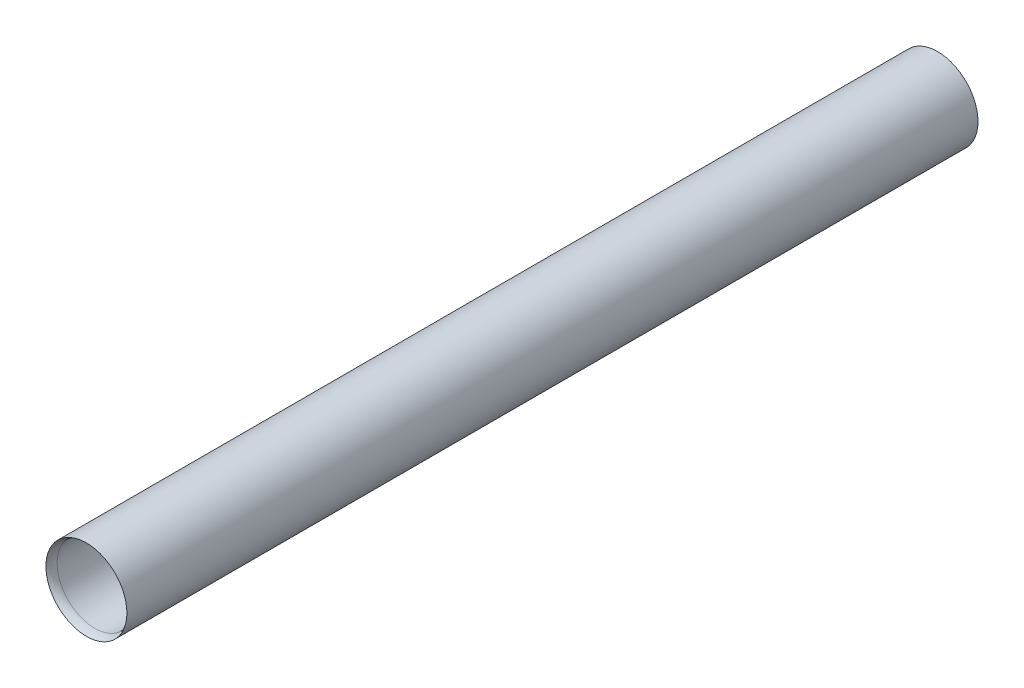
ISO-10303-21;
HEADER;
FILE_DESCRIPTION(('STEP AP214'),'2;1');
FILE_NAME('part.step','',(''),(''),'','','');
FILE_SCHEMA(('AUTOMOTIVE_DESIGN { 1 0 10303 214 1 1 1 1 }'));
ENDSEC;
DATA;
#1=APPLICATION_CONTEXT('core data for automotive mechanical design processes');
#2=APPLICATION_PROTOCOL_DEFINITION('international standard','automotive_design',2000,#1);
#3=PRODUCT_CONTEXT('',#1,'mechanical');
#4=PRODUCT('Part','Part','',(#3));
#5=PRODUCT_RELATED_PRODUCT_CATEGORY('part','',(#4));
#6=PRODUCT_DEFINITION_FORMATION('','',#4);
#7=PRODUCT_DEFINITION_CONTEXT('part definition',#1,'design');
#8=PRODUCT_DEFINITION('design','',#6,#7);
#9=PRODUCT_DEFINITION_SHAPE('','',#8);
#10=(LENGTH_UNIT() NAMED_UNIT(*) SI_UNIT(.MILLI.,.METRE.));
#11=(NAMED_UNIT(*) PLANE_ANGLE_UNIT() SI_UNIT($,.RADIAN.));
#12=(NAMED_UNIT(*) SI_UNIT($,.STERADIAN.) SOLID_ANGLE_UNIT());
#13=UNCERTAINTY_MEASURE_WITH_UNIT(LENGTH_MEASURE(1.E-05),#10,'distance_accuracy_value','');
#14=(GEOMETRIC_REPRESENTATION_CONTEXT(3) GLOBAL_UNCERTAINTY_ASSIGNED_CONTEXT((#13)) GLOBAL_UNIT_ASSIGNED_CONTEXT((#10,
#11,#12)) REPRESENTATION_CONTEXT('',''));
#15=CARTESIAN_POINT('',(0.,0.,0.));
#16=DIRECTION('',(0.,0.,1.));
#17=DIRECTION('',(1.,0.,0.));
#18=AXIS2_PLACEMENT_3D('',#15,#16,#17);
#19=CARTESIAN_POINT('',(0.,0.,-304.8));
#20=DIRECTION('',(0.,0.,1.));
#21=DIRECTION('',(1.,0.,0.));
#22=AXIS2_PLACEMENT_3D('',#19,#20,#21);
#23=CYLINDRICAL_SURFACE('',#22,14.5);
#24=CARTESIAN_POINT('',(0.,0.,-304.8));
#25=DIRECTION('',(0.,0.,1.));
#26=DIRECTION('',(1.,0.,0.));
#27=AXIS2_PLACEMENT_3D('',#24,#25,#26);
#28=CIRCLE('',#27,14.5);
#29=CARTESIAN_POINT('',(14.5,0.,-304.8));
#30=VERTEX_POINT('',#29);
#31=EDGE_CURVE('E38',#30,#30,#28,.T.);
#32=CARTESIAN_POINT('',(0.,0.,0.));
#33=DIRECTION('',(0.,0.,1.));
#34=DIRECTION('',(1.,0.,0.));
#35=AXIS2_PLACEMENT_3D('',#32,#33,#34);
#36=CIRCLE('',#35,14.5);
#37=CARTESIAN_POINT('',(14.5,0.,0.));
#38=VERTEX_POINT('',#37);
#39=EDGE_CURVE('E42',#38,#38,#36,.T.);
#40=CARTESIAN_POINT('',(14.5,0.,-304.8));
#41=CARTESIAN_POINT('',(14.5,0.,-301.625));
#42=CARTESIAN_POINT('',(14.5,0.,-298.45));
#43=CARTESIAN_POINT('',(14.5,0.,-292.1));
#44=CARTESIAN_POINT('',(14.5,0.,-288.925));
#45=CARTESIAN_POINT('',(14.5,0.,-282.575));
#46=CARTESIAN_POINT('',(14.5,0.,-279.4));
#47=CARTESIAN_POINT('',(14.5,0.,-273.05));
#48=CARTESIAN_POINT('',(14.5,0.,-269.875));
#49=CARTESIAN_POINT('',(14.5,0.,-263.525));
#50=CARTESIAN_POINT('',(14.5,0.,-260.35));
#51=CARTESIAN_POINT('',(14.5,0.,-254.));
#52=CARTESIAN_POINT('',(14.5,0.,-250.825));
#53=CARTESIAN_POINT('',(14.5,0.,-244.475));
#54=CARTESIAN_POINT('',(14.5,0.,-241.3));
#55=CARTESIAN_POINT('',(14.5,0.,-234.95));
#56=CARTESIAN_POINT('',(14.5,0.,-231.775));
#57=CARTESIAN_POINT('',(14.5,0.,-225.425));
#58=CARTESIAN_POINT('',(14.5,0.,-222.25));
#59=CARTESIAN_POINT('',(14.5,0.,-215.9));
#60=CARTESIAN_POINT('',(14.5,0.,-212.725));
#61=CARTESIAN_POINT('',(14.5,0.,-206.375));
#62=CARTESIAN_POINT('',(14.5,0.,-203.2));
#63=CARTESIAN_POINT('',(14.5,0.,-196.85));
#64=CARTESIAN_POINT('',(14.5,0.,-193.675));
#65=CARTESIAN_POINT('',(14.5,0.,-187.325));
#66=CARTESIAN_POINT('',(14.5,0.,-184.15));
#67=CARTESIAN_POINT('',(14.5,0.,-177.8));
#68=CARTESIAN_POINT('',(14.5,0.,-174.625));
#69=CARTESIAN_POINT('',(14.5,0.,-168.275));
#70=CARTESIAN_POINT('',(14.5,0.,-165.1));
#71=CARTESIAN_POINT('',(14.5,0.,-158.75));
#72=CARTESIAN_POINT('',(14.5,0.,-155.575));
#73=CARTESIAN_POINT('',(14.5,0.,-149.225));
#74=CARTESIAN_POINT('',(14.5,0.,-146.05));
#75=CARTESIAN_POINT('',(14.5,0.,-139.7));
#76=CARTESIAN_POINT('',(14.5,0.,-136.525));
#77=CARTESIAN_POINT('',(14.5,0.,-130.175));
#78=CARTESIAN_POINT('',(14.5,0.,-127.));
#79=CARTESIAN_POINT('',(14.5,0.,-120.65));
#80=CARTESIAN_POINT('',(14.5,0.,-117.475));
#81=CARTESIAN_POINT('',(14.5,0.,-111.125));
#82=CARTESIAN_POINT('',(14.5,0.,-107.95));
#83=CARTESIAN_POINT('',(14.5,0.,-101.6));
#84=CARTESIAN_POINT('',(14.5,0.,-98.425));
#85=CARTESIAN_POINT('',(14.5,0.,-92.075));
#86=CARTESIAN_POINT('',(14.5,0.,-88.9));
#87=CARTESIAN_POINT('',(14.5,0.,-82.55));
#88=CARTESIAN_POINT('',(14.5,0.,-79.375));
#89=CARTESIAN_POINT('',(14.5,0.,-73.025));
#90=CARTESIAN_POINT('',(14.5,0.,-69.85));
#91=CARTESIAN_POINT('',(14.5,0.,-63.5));
#92=CARTESIAN_POINT('',(14.5,0.,-60.325));
#93=CARTESIAN_POINT('',(14.5,0.,-53.975));
#94=CARTESIAN_POINT('',(14.5,0.,-50.8));
#95=CARTESIAN_POINT('',(14.5,0.,-44.45));
#96=CARTESIAN_POINT('',(14.5,0.,-41.275));
#97=CARTESIAN_POINT('',(14.5,0.,-34.925));
#98=CARTESIAN_POINT('',(14.5,0.,-31.75));
#99=CARTESIAN_POINT('',(14.5,0.,-25.4));
#100=CARTESIAN_POINT('',(14.5,0.,-22.225));
#101=CARTESIAN_POINT('',(14.5,0.,-15.875));
#102=CARTESIAN_POINT('',(14.5,0.,-12.7));
#103=CARTESIAN_POINT('',(14.5,0.,-6.35));
#104=CARTESIAN_POINT('',(14.5,0.,-3.175));
#105=CARTESIAN_POINT('',(14.5,0.,0.));
#106=B_SPLINE_CURVE_WITH_KNOTS('',3,(#40,#41,#42,#43,#44,#45,#46,#47,#48,#49,#50,#51,#52,#53,
#54,#55,#56,#57,#58,#59,#60,#61,#62,#63,#64,#65,#66,#67,#68,#69,#70,#71,#72,#73,#74,#75,#76,#77,
#78,#79,#80,#81,#82,#83,#84,#85,#86,#87,#88,#89,#90,#91,#92,#93,#94,#95,#96,#97,#98,#99,#100,
#101,#102,#103,#104,#105),.UNSPECIFIED.,.F.,.F.,(4,2,2,2,2,2,2,2,2,2,2,2,2,2,2,2,2,2,2,2,2,2,2,
2,2,2,2,2,2,2,2,2,4),(0.,9.52499999999995,19.05,28.575,38.1,47.625,57.15,66.675,76.2,85.725,
95.25,104.775,114.3,123.825,133.35,142.875,152.4,161.925,171.45,180.975,190.5,200.025,209.55,
219.075,228.6,238.125,247.65,257.175,266.7,276.225,285.75,295.275,304.8),.UNSPECIFIED.);
#107=EDGE_CURVE('BSEAM31',#30,#38,#106,.T.);
#108=ORIENTED_EDGE('',*,*,#31,.T.);
#109=ORIENTED_EDGE('',*,*,#39,.F.);
#110=ORIENTED_EDGE('',*,*,#107,.T.);
#111=ORIENTED_EDGE('',*,*,#107,.F.);
#112=EDGE_LOOP('',(#108,#110,#109,#111));
#113=FACE_BOUND('',#112,.T.);
#114=ADVANCED_FACE('F31',(#113),#23,.T.);
#115=CARTESIAN_POINT('',(0.,0.,-304.8));
#116=DIRECTION('',(0.,0.,1.));
#117=DIRECTION('',(1.,0.,0.));
#118=AXIS2_PLACEMENT_3D('',#115,#116,#117);
#119=PLANE('',#118);
#120=CARTESIAN_POINT('',(0.,0.,-304.8));
#121=DIRECTION('',(0.,0.,1.));
#122=DIRECTION('',(1.,0.,0.));
#123=AXIS2_PLACEMENT_3D('',#120,#121,#122);
#124=CIRCLE('',#123,13.5);
#125=CARTESIAN_POINT('',(13.5,0.,-304.8));
#126=VERTEX_POINT('',#125);
#127=EDGE_CURVE('E47',#126,#126,#124,.T.);
#128=ORIENTED_EDGE('',*,*,#127,.T.);
#129=EDGE_LOOP('',(#128));
#130=FACE_BOUND('',#129,.T.);
#131=ORIENTED_EDGE('',*,*,#31,.F.);
#132=EDGE_LOOP('',(#131));
#133=FACE_BOUND('',#132,.T.);
#134=ADVANCED_FACE('F52',(#130,#133),#119,.F.);
#135=CARTESIAN_POINT('',(0.,0.,-304.8));
#136=DIRECTION('',(0.,0.,1.));
#137=DIRECTION('',(1.,0.,0.));
#138=AXIS2_PLACEMENT_3D('',#135,#136,#137);
#139=CYLINDRICAL_SURFACE('',#138,13.5);
#140=CARTESIAN_POINT('',(0.,0.,-3.00000000000006));
#141=DIRECTION('',(0.,0.,1.));
#142=DIRECTION('',(1.,0.,0.));
#143=AXIS2_PLACEMENT_3D('',#140,#141,#142);
#144=CIRCLE('',#143,13.5);
#145=CARTESIAN_POINT('',(13.5,0.,-3.00000000000011));
#146=VERTEX_POINT('',#145);
#147=EDGE_CURVE('E10',#146,#146,#144,.T.);
#148=CARTESIAN_POINT('',(13.5,0.,-3.00000000000011));
#149=CARTESIAN_POINT('',(13.5,0.,-6.14375000000011));
#150=CARTESIAN_POINT('',(13.5,0.,-9.28750000000012));
#151=CARTESIAN_POINT('',(13.5,0.,-15.5750000000001));
#152=CARTESIAN_POINT('',(13.5,0.,-18.7187500000001));
#153=CARTESIAN_POINT('',(13.5,0.,-25.0062500000001));
#154=CARTESIAN_POINT('',(13.5,0.,-28.1500000000001));
#155=CARTESIAN_POINT('',(13.5,0.,-34.4375000000001));
#156=CARTESIAN_POINT('',(13.5,0.,-37.5812500000001));
#157=CARTESIAN_POINT('',(13.5,0.,-43.8687500000001));
#158=CARTESIAN_POINT('',(13.5,0.,-47.0125000000001));
#159=CARTESIAN_POINT('',(13.5,0.,-53.3000000000001));
#160=CARTESIAN_POINT('',(13.5,0.,-56.4437500000001));
#161=CARTESIAN_POINT('',(13.5,0.,-62.7312500000001));
#162=CARTESIAN_POINT('',(13.5,0.,-65.8750000000001));
#163=CARTESIAN_POINT('',(13.5,0.,-72.1625000000001));
#164=CARTESIAN_POINT('',(13.5,0.,-75.3062500000001));
#165=CARTESIAN_POINT('',(13.5,0.,-81.5937500000001));
#166=CARTESIAN_POINT('',(13.5,0.,-84.7375000000001));
#167=CARTESIAN_POINT('',(13.5,0.,-91.0250000000001));
#168=CARTESIAN_POINT('',(13.5,0.,-94.1687500000001));
#169=CARTESIAN_POINT('',(13.5,0.,-100.45625));
#170=CARTESIAN_POINT('',(13.5,0.,-103.6));
#171=CARTESIAN_POINT('',(13.5,0.,-109.8875));
#172=CARTESIAN_POINT('',(13.5,0.,-113.03125));
#173=CARTESIAN_POINT('',(13.5,0.,-119.31875));
#174=CARTESIAN_POINT('',(13.5,0.,-122.4625));
#175=CARTESIAN_POINT('',(13.5,0.,-128.75));
#176=CARTESIAN_POINT('',(13.5,0.,-131.89375));
#177=CARTESIAN_POINT('',(13.5,0.,-138.18125));
#178=CARTESIAN_POINT('',(13.5,0.,-141.325));
#179=CARTESIAN_POINT('',(13.5,0.,-147.6125));
#180=CARTESIAN_POINT('',(13.5,0.,-150.75625));
#181=CARTESIAN_POINT('',(13.5,0.,-157.04375));
#182=CARTESIAN_POINT('',(13.5,0.,-160.1875));
#183=CARTESIAN_POINT('',(13.5,0.,-166.475));
#184=CARTESIAN_POINT('',(13.5,0.,-169.61875));
#185=CARTESIAN_POINT('',(13.5,0.,-175.90625));
#186=CARTESIAN_POINT('',(13.5,0.,-179.05));
#187=CARTESIAN_POINT('',(13.5,0.,-185.3375));
#188=CARTESIAN_POINT('',(13.5,0.,-188.48125));
#189=CARTESIAN_POINT('',(13.5,0.,-194.76875));
#190=CARTESIAN_POINT('',(13.5,0.,-197.9125));
#191=CARTESIAN_POINT('',(13.5,0.,-204.2));
#192=CARTESIAN_POINT('',(13.5,0.,-207.34375));
#193=CARTESIAN_POINT('',(13.5,0.,-213.63125));
#194=CARTESIAN_POINT('',(13.5,0.,-216.775));
#195=CARTESIAN_POINT('',(13.5,0.,-223.0625));
#196=CARTESIAN_POINT('',(13.5,0.,-226.20625));
#197=CARTESIAN_POINT('',(13.5,0.,-232.49375));
#198=CARTESIAN_POINT('',(13.5,0.,-235.6375));
#199=CARTESIAN_POINT('',(13.5,0.,-241.925));
#200=CARTESIAN_POINT('',(13.5,0.,-245.06875));
#201=CARTESIAN_POINT('',(13.5,0.,-251.35625));
#202=CARTESIAN_POINT('',(13.5,0.,-254.5));
#203=CARTESIAN_POINT('',(13.5,0.,-260.7875));
#204=CARTESIAN_POINT('',(13.5,0.,-263.93125));
#205=CARTESIAN_POINT('',(13.5,0.,-270.21875));
#206=CARTESIAN_POINT('',(13.5,0.,-273.3625));
#207=CARTESIAN_POINT('',(13.5,0.,-279.65));
#208=CARTESIAN_POINT('',(13.5,0.,-282.79375));
#209=CARTESIAN_POINT('',(13.5,0.,-289.08125));
#210=CARTESIAN_POINT('',(13.5,0.,-292.225));
#211=CARTESIAN_POINT('',(13.5,0.,-298.5125));
#212=CARTESIAN_POINT('',(13.5,0.,-301.65625));
#213=CARTESIAN_POINT('',(13.5,0.,-304.8));
#214=B_SPLINE_CURVE_WITH_KNOTS('',3,(#148,#149,#150,#151,#152,#153,#154,#155,#156,#157,#158,
#159,#160,#161,#162,#163,#164,#165,#166,#167,#168,#169,#170,#171,#172,#173,#174,#175,#176,#177,
#178,#179,#180,#181,#182,#183,#184,#185,#186,#187,#188,#189,#190,#191,#192,#193,#194,#195,#196,
#197,#198,#199,#200,#201,#202,#203,#204,#205,#206,#207,#208,#209,#210,#211,#212,#213),
.UNSPECIFIED.,.F.,.F.,(4,2,2,2,2,2,2,2,2,2,2,2,2,2,2,2,2,2,2,2,2,2,2,2,2,2,2,2,2,2,2,2,4),(0.,
9.43125,18.8625,28.29375,37.725,47.15625,56.5875,66.01875,75.45,84.88125,94.3125,103.74375,
113.175,122.60625,132.0375,141.46875,150.9,160.33125,169.7625,179.19375,188.625,198.05625,
207.4875,216.91875,226.35,235.78125,245.2125,254.64375,264.075,273.50625,282.9375,292.36875,
301.8),.UNSPECIFIED.);
#215=EDGE_CURVE('BSEAM55',#146,#126,#214,.T.);
#216=ORIENTED_EDGE('',*,*,#147,.T.);
#217=ORIENTED_EDGE('',*,*,#127,.F.);
#218=ORIENTED_EDGE('',*,*,#215,.T.);
#219=ORIENTED_EDGE('',*,*,#215,.F.);
#220=EDGE_LOOP('',(#216,#218,#217,#219));
#221=FACE_BOUND('',#220,.T.);
#222=ADVANCED_FACE('F55',(#221),#139,.F.);
#223=CARTESIAN_POINT('',(0.,0.,-3.));
#224=DIRECTION('',(0.,0.,1.));
#225=DIRECTION('',(1.,0.,0.));
#226=AXIS2_PLACEMENT_3D('',#223,#224,#225);
#227=TOROIDAL_SURFACE('',#226,18.5,5.);
#228=ORIENTED_EDGE('',*,*,#39,.T.);
#229=EDGE_LOOP('',(#228));
#230=FACE_BOUND('',#229,.T.);
#231=ORIENTED_EDGE('',*,*,#147,.F.);
#232=EDGE_LOOP('',(#231));
#233=FACE_BOUND('',#232,.T.);
#234=ADVANCED_FACE('F33',(#230,#233),#227,.T.);
#235=CLOSED_SHELL('',(#114,#134,#222,#234));
#236=MANIFOLD_SOLID_BREP('B2',#235);
#237=ADVANCED_BREP_SHAPE_REPRESENTATION('',(#18,#236),#14);
#238=SHAPE_DEFINITION_REPRESENTATION(#9,#237);
ENDSEC;
END-ISO-10303-21;
